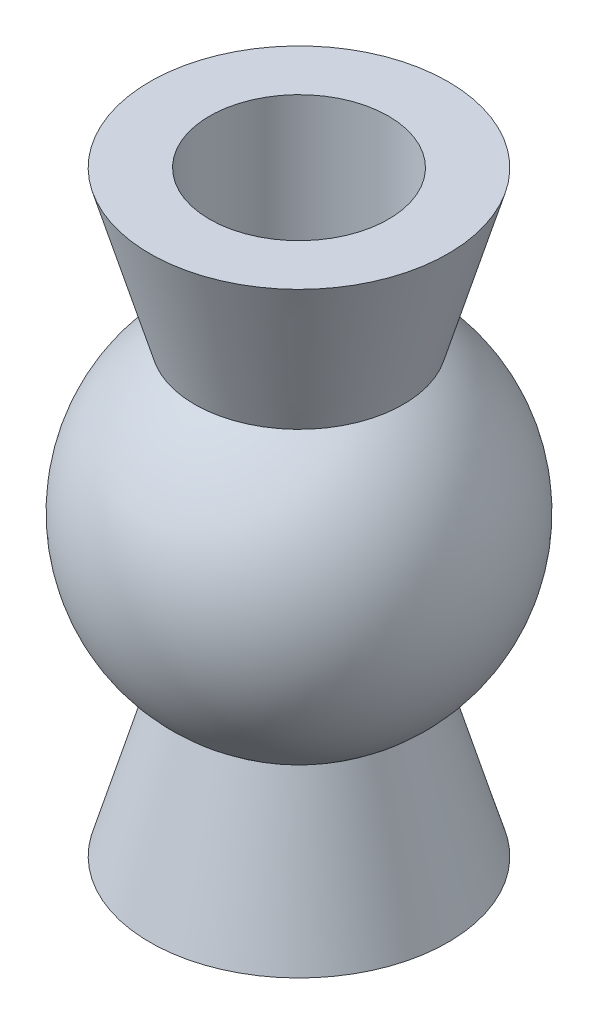
ISO-10303-21;
HEADER;
FILE_DESCRIPTION(('STEP AP214'),'2;1');
FILE_NAME('part.step','',(''),(''),'','','');
FILE_SCHEMA(('AUTOMOTIVE_DESIGN { 1 0 10303 214 1 1 1 1 }'));
ENDSEC;
DATA;
#1=APPLICATION_CONTEXT('core data for automotive mechanical design processes');
#2=APPLICATION_PROTOCOL_DEFINITION('international standard','automotive_design',2000,#1);
#3=PRODUCT_CONTEXT('',#1,'mechanical');
#4=PRODUCT('Part','Part','',(#3));
#5=PRODUCT_RELATED_PRODUCT_CATEGORY('part','',(#4));
#6=PRODUCT_DEFINITION_FORMATION('','',#4);
#7=PRODUCT_DEFINITION_CONTEXT('part definition',#1,'design');
#8=PRODUCT_DEFINITION('design','',#6,#7);
#9=PRODUCT_DEFINITION_SHAPE('','',#8);
#10=(LENGTH_UNIT() NAMED_UNIT(*) SI_UNIT(.MILLI.,.METRE.));
#11=(NAMED_UNIT(*) PLANE_ANGLE_UNIT() SI_UNIT($,.RADIAN.));
#12=(NAMED_UNIT(*) SI_UNIT($,.STERADIAN.) SOLID_ANGLE_UNIT());
#13=UNCERTAINTY_MEASURE_WITH_UNIT(LENGTH_MEASURE(1.E-05),#10,'distance_accuracy_value','');
#14=(GEOMETRIC_REPRESENTATION_CONTEXT(3) GLOBAL_UNCERTAINTY_ASSIGNED_CONTEXT((#13)) GLOBAL_UNIT_ASSIGNED_CONTEXT((#10,
#11,#12)) REPRESENTATION_CONTEXT('',''));
#15=CARTESIAN_POINT('',(0.,0.,0.));
#16=DIRECTION('',(0.,0.,1.));
#17=DIRECTION('',(1.,0.,0.));
#18=AXIS2_PLACEMENT_3D('',#15,#16,#17);
#19=CARTESIAN_POINT('',(0.,0.,0.));
#20=DIRECTION('',(0.,-1.,0.));
#21=DIRECTION('',(0.,0.,-1.));
#22=AXIS2_PLACEMENT_3D('',#19,#20,#21);
#23=CONICAL_SURFACE('',#22,2.5,0.284646149681152);
#24=CARTESIAN_POINT('',(0.,2.56330141379776,0.));
#25=DIRECTION('',(0.,-1.,0.));
#26=DIRECTION('',(0.,0.,-1.));
#27=AXIS2_PLACEMENT_3D('',#24,#25,#26);
#28=CIRCLE('',#27,1.75);
#29=CARTESIAN_POINT('',(0.,2.56330141379776,-1.75));
#30=VERTEX_POINT('',#29);
#31=EDGE_CURVE('E10',#30,#30,#28,.T.);
#32=ORIENTED_EDGE('',*,*,#31,.T.);
#33=EDGE_LOOP('',(#32));
#34=FACE_BOUND('',#33,.T.);
#35=CARTESIAN_POINT('',(0.,0.,0.));
#36=DIRECTION('',(0.,-1.,0.));
#37=DIRECTION('',(0.,0.,-1.));
#38=AXIS2_PLACEMENT_3D('',#35,#36,#37);
#39=CIRCLE('',#38,2.5);
#40=CARTESIAN_POINT('',(0.,0.,-2.5));
#41=VERTEX_POINT('',#40);
#42=EDGE_CURVE('E53',#41,#41,#39,.T.);
#43=ORIENTED_EDGE('',*,*,#42,.F.);
#44=EDGE_LOOP('',(#43));
#45=FACE_BOUND('',#44,.T.);
#46=ADVANCED_FACE('F31',(#34,#45),#23,.T.);
#47=CARTESIAN_POINT('',(0.,5.,0.));
#48=DIRECTION('',(0.,-1.,0.));
#49=DIRECTION('',(1.,0.,0.));
#50=AXIS2_PLACEMENT_3D('',#47,#48,#49);
#51=SPHERICAL_SURFACE('',#50,3.);
#52=CARTESIAN_POINT('',(0.,7.43669858620224,0.));
#53=DIRECTION('',(0.,-1.,0.));
#54=DIRECTION('',(0.,0.,-1.));
#55=AXIS2_PLACEMENT_3D('',#52,#53,#54);
#56=CIRCLE('',#55,1.75);
#57=CARTESIAN_POINT('',(0.,7.43669858620224,-1.75));
#58=VERTEX_POINT('',#57);
#59=EDGE_CURVE('E37',#58,#58,#56,.T.);
#60=ORIENTED_EDGE('',*,*,#59,.T.);
#61=EDGE_LOOP('',(#60));
#62=FACE_BOUND('',#61,.T.);
#63=ORIENTED_EDGE('',*,*,#31,.F.);
#64=EDGE_LOOP('',(#63));
#65=FACE_BOUND('',#64,.T.);
#66=ADVANCED_FACE('F61',(#62,#65),#51,.T.);
#67=CARTESIAN_POINT('',(0.,7.43669858620224,0.));
#68=DIRECTION('',(0.,1.,0.));
#69=DIRECTION('',(0.,0.,1.));
#70=AXIS2_PLACEMENT_3D('',#67,#68,#69);
#71=CONICAL_SURFACE('',#70,1.75,0.284646149681152);
#72=CARTESIAN_POINT('',(0.,10.,0.));
#73=DIRECTION('',(0.,-1.,0.));
#74=DIRECTION('',(0.,0.,-1.));
#75=AXIS2_PLACEMENT_3D('',#72,#73,#74);
#76=CIRCLE('',#75,2.5);
#77=CARTESIAN_POINT('',(0.,10.,-2.5));
#78=VERTEX_POINT('',#77);
#79=EDGE_CURVE('E41',#78,#78,#76,.T.);
#80=ORIENTED_EDGE('',*,*,#79,.T.);
#81=EDGE_LOOP('',(#80));
#82=FACE_BOUND('',#81,.T.);
#83=ORIENTED_EDGE('',*,*,#59,.F.);
#84=EDGE_LOOP('',(#83));
#85=FACE_BOUND('',#84,.T.);
#86=ADVANCED_FACE('F65',(#82,#85),#71,.T.);
#87=CARTESIAN_POINT('',(1.5,10.,0.));
#88=DIRECTION('',(0.,1.,0.));
#89=DIRECTION('',(0.,0.,1.));
#90=AXIS2_PLACEMENT_3D('',#87,#88,#89);
#91=PLANE('',#90);
#92=CARTESIAN_POINT('',(0.,10.,0.));
#93=DIRECTION('',(0.,-1.,0.));
#94=DIRECTION('',(0.,0.,-1.));
#95=AXIS2_PLACEMENT_3D('',#92,#93,#94);
#96=CIRCLE('',#95,1.5);
#97=CARTESIAN_POINT('',(0.,10.,-1.5));
#98=VERTEX_POINT('',#97);
#99=EDGE_CURVE('E45',#98,#98,#96,.T.);
#100=ORIENTED_EDGE('',*,*,#99,.T.);
#101=EDGE_LOOP('',(#100));
#102=FACE_BOUND('',#101,.T.);
#103=ORIENTED_EDGE('',*,*,#79,.F.);
#104=EDGE_LOOP('',(#103));
#105=FACE_BOUND('',#104,.T.);
#106=ADVANCED_FACE('F69',(#102,#105),#91,.T.);
#107=CARTESIAN_POINT('',(0.,0.,0.));
#108=DIRECTION('',(0.,-1.,0.));
#109=DIRECTION('',(0.,0.,-1.));
#110=AXIS2_PLACEMENT_3D('',#107,#108,#109);
#111=CYLINDRICAL_SURFACE('',#110,1.5);
#112=CARTESIAN_POINT('',(0.,0.,0.));
#113=DIRECTION('',(0.,-1.,0.));
#114=DIRECTION('',(0.,0.,-1.));
#115=AXIS2_PLACEMENT_3D('',#112,#113,#114);
#116=CIRCLE('',#115,1.5);
#117=CARTESIAN_POINT('',(0.,0.,-1.5));
#118=VERTEX_POINT('',#117);
#119=EDGE_CURVE('E50',#118,#118,#116,.T.);
#120=ORIENTED_EDGE('',*,*,#119,.T.);
#121=EDGE_LOOP('',(#120));
#122=FACE_BOUND('',#121,.T.);
#123=ORIENTED_EDGE('',*,*,#99,.F.);
#124=EDGE_LOOP('',(#123));
#125=FACE_BOUND('',#124,.T.);
#126=ADVANCED_FACE('F76',(#122,#125),#111,.F.);
#127=CARTESIAN_POINT('',(2.5,0.,0.));
#128=DIRECTION('',(0.,-1.,0.));
#129=DIRECTION('',(0.,0.,-1.));
#130=AXIS2_PLACEMENT_3D('',#127,#128,#129);
#131=PLANE('',#130);
#132=ORIENTED_EDGE('',*,*,#42,.T.);
#133=EDGE_LOOP('',(#132));
#134=FACE_BOUND('',#133,.T.);
#135=ORIENTED_EDGE('',*,*,#119,.F.);
#136=EDGE_LOOP('',(#135));
#137=FACE_BOUND('',#136,.T.);
#138=ADVANCED_FACE('F57',(#134,#137),#131,.T.);
#139=CLOSED_SHELL('',(#46,#66,#86,#106,#126,#138));
#140=MANIFOLD_SOLID_BREP('B2',#139);
#141=ADVANCED_BREP_SHAPE_REPRESENTATION('',(#18,#140),#14);
#142=SHAPE_DEFINITION_REPRESENTATION(#9,#141);
ENDSEC;
END-ISO-10303-21;
